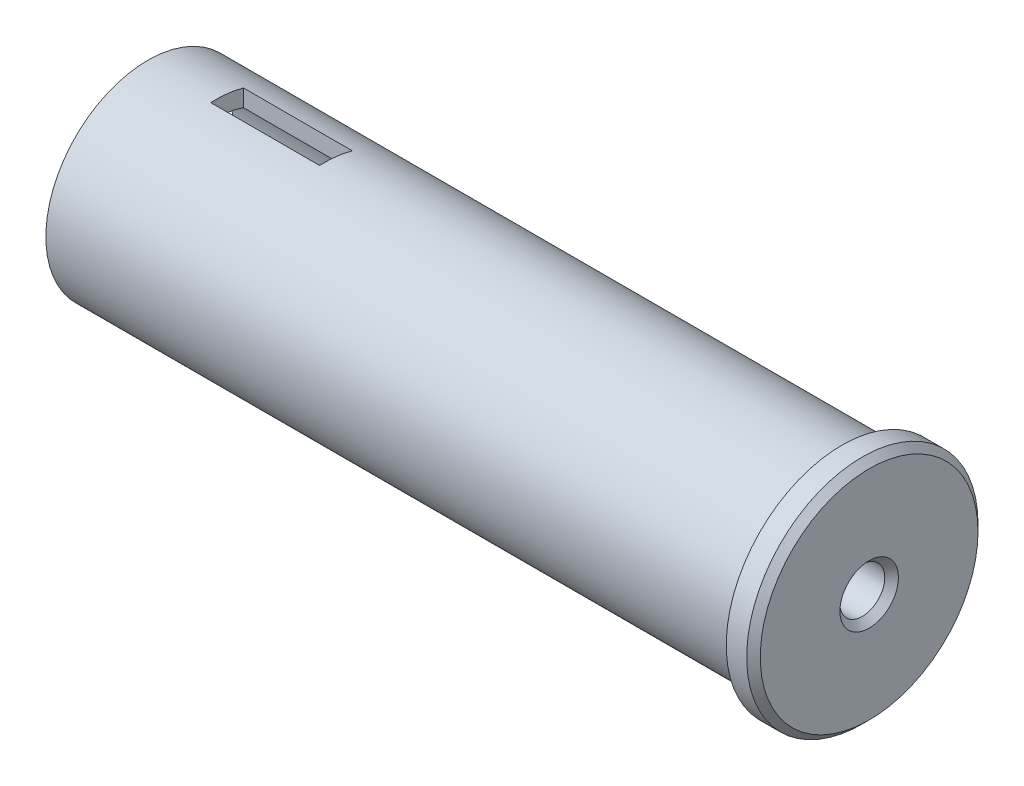
ISO-10303-21;
HEADER;
FILE_DESCRIPTION(('STEP AP214'),'2;1');
FILE_NAME('part.step','',(''),(''),'','','');
FILE_SCHEMA(('AUTOMOTIVE_DESIGN { 1 0 10303 214 1 1 1 1 }'));
ENDSEC;
DATA;
#1=APPLICATION_CONTEXT('core data for automotive mechanical design processes');
#2=APPLICATION_PROTOCOL_DEFINITION('international standard','automotive_design',2000,#1);
#3=PRODUCT_CONTEXT('',#1,'mechanical');
#4=PRODUCT('Part','Part','',(#3));
#5=PRODUCT_RELATED_PRODUCT_CATEGORY('part','',(#4));
#6=PRODUCT_DEFINITION_FORMATION('','',#4);
#7=PRODUCT_DEFINITION_CONTEXT('part definition',#1,'design');
#8=PRODUCT_DEFINITION('design','',#6,#7);
#9=PRODUCT_DEFINITION_SHAPE('','',#8);
#10=(LENGTH_UNIT() NAMED_UNIT(*) SI_UNIT(.MILLI.,.METRE.));
#11=(NAMED_UNIT(*) PLANE_ANGLE_UNIT() SI_UNIT($,.RADIAN.));
#12=(NAMED_UNIT(*) SI_UNIT($,.STERADIAN.) SOLID_ANGLE_UNIT());
#13=UNCERTAINTY_MEASURE_WITH_UNIT(LENGTH_MEASURE(1.E-05),#10,'distance_accuracy_value','');
#14=(GEOMETRIC_REPRESENTATION_CONTEXT(3) GLOBAL_UNCERTAINTY_ASSIGNED_CONTEXT((#13)) GLOBAL_UNIT_ASSIGNED_CONTEXT((#10,
#11,#12)) REPRESENTATION_CONTEXT('',''));
#15=CARTESIAN_POINT('',(0.,0.,0.));
#16=DIRECTION('',(0.,0.,1.));
#17=DIRECTION('',(1.,0.,0.));
#18=AXIS2_PLACEMENT_3D('',#15,#16,#17);
#19=CARTESIAN_POINT('',(0.,0.,-8.50000000000001));
#20=DIRECTION('',(1.,0.,0.));
#21=DIRECTION('',(0.,0.,-1.));
#22=AXIS2_PLACEMENT_3D('',#19,#20,#21);
#23=PLANE('',#22);
#24=CARTESIAN_POINT('',(0.,0.,0.));
#25=DIRECTION('',(1.,0.,0.));
#26=DIRECTION('',(0.,0.,-1.));
#27=AXIS2_PLACEMENT_3D('',#24,#25,#26);
#28=CIRCLE('',#27,2.15);
#29=CARTESIAN_POINT('',(0.,0.,-2.15));
#30=VERTEX_POINT('',#29);
#31=EDGE_CURVE('E155',#30,#30,#28,.F.);
#32=ORIENTED_EDGE('',*,*,#31,.T.);
#33=EDGE_LOOP('',(#32));
#34=FACE_BOUND('',#33,.T.);
#35=CARTESIAN_POINT('',(0.,0.,0.));
#36=DIRECTION('',(1.,0.,0.));
#37=DIRECTION('',(0.,0.,-1.));
#38=AXIS2_PLACEMENT_3D('',#35,#36,#37);
#39=CIRCLE('',#38,8.00000000000001);
#40=CARTESIAN_POINT('',(0.,0.,-8.00000000000001));
#41=VERTEX_POINT('',#40);
#42=EDGE_CURVE('E152',#41,#41,#39,.T.);
#43=ORIENTED_EDGE('',*,*,#42,.T.);
#44=EDGE_LOOP('',(#43));
#45=FACE_BOUND('',#44,.T.);
#46=ADVANCED_FACE('F33',(#34,#45),#23,.T.);
#47=CARTESIAN_POINT('',(0.,0.,0.));
#48=DIRECTION('',(1.,0.,0.));
#49=DIRECTION('',(0.,0.,-1.));
#50=AXIS2_PLACEMENT_3D('',#47,#48,#49);
#51=CYLINDRICAL_SURFACE('',#50,1.65);
#52=CARTESIAN_POINT('',(-0.500000000000004,0.,0.));
#53=DIRECTION('',(1.,0.,0.));
#54=DIRECTION('',(0.,0.,-1.));
#55=AXIS2_PLACEMENT_3D('',#52,#53,#54);
#56=CIRCLE('',#55,1.65);
#57=CARTESIAN_POINT('',(-0.500000000000004,0.,-1.65));
#58=VERTEX_POINT('',#57);
#59=EDGE_CURVE('E149',#58,#58,#56,.T.);
#60=ORIENTED_EDGE('',*,*,#59,.T.);
#61=EDGE_LOOP('',(#60));
#62=FACE_BOUND('',#61,.T.);
#63=CARTESIAN_POINT('',(-11.,0.,0.));
#64=DIRECTION('',(1.,0.,0.));
#65=DIRECTION('',(0.,0.,-1.));
#66=AXIS2_PLACEMENT_3D('',#63,#64,#65);
#67=CIRCLE('',#66,1.65);
#68=CARTESIAN_POINT('',(-11.,0.,-1.65));
#69=VERTEX_POINT('',#68);
#70=EDGE_CURVE('E146',#69,#69,#67,.T.);
#71=ORIENTED_EDGE('',*,*,#70,.F.);
#72=EDGE_LOOP('',(#71));
#73=FACE_BOUND('',#72,.T.);
#74=ADVANCED_FACE('F218',(#62,#73),#51,.F.);
#75=CARTESIAN_POINT('',(-11.,0.,-1.65));
#76=DIRECTION('',(-1.,0.,0.));
#77=DIRECTION('',(0.,0.,1.));
#78=AXIS2_PLACEMENT_3D('',#75,#76,#77);
#79=PLANE('',#78);
#80=ORIENTED_EDGE('',*,*,#70,.T.);
#81=EDGE_LOOP('',(#80));
#82=FACE_BOUND('',#81,.T.);
#83=CARTESIAN_POINT('',(-11.,0.,0.));
#84=DIRECTION('',(1.,0.,0.));
#85=DIRECTION('',(0.,0.,-1.));
#86=AXIS2_PLACEMENT_3D('',#83,#84,#85);
#87=CIRCLE('',#86,6.30000000000001);
#88=CARTESIAN_POINT('',(-11.,0.,-6.30000000000001));
#89=VERTEX_POINT('',#88);
#90=EDGE_CURVE('E143',#89,#89,#87,.T.);
#91=ORIENTED_EDGE('',*,*,#90,.F.);
#92=EDGE_LOOP('',(#91));
#93=FACE_BOUND('',#92,.T.);
#94=ADVANCED_FACE('F224',(#82,#93),#79,.T.);
#95=CARTESIAN_POINT('',(0.,0.,0.));
#96=DIRECTION('',(1.,0.,0.));
#97=DIRECTION('',(0.,0.,-1.));
#98=AXIS2_PLACEMENT_3D('',#95,#96,#97);
#99=CYLINDRICAL_SURFACE('',#98,6.30000000000001);
#100=CARTESIAN_POINT('',(-48.,0.,0.));
#101=DIRECTION('',(-1.,0.,0.));
#102=DIRECTION('',(0.,0.,1.));
#103=AXIS2_PLACEMENT_3D('',#100,#101,#102);
#104=CIRCLE('',#103,6.30000000000001);
#105=CARTESIAN_POINT('',(-48.,-5.96837058150195,-2.0170653439743));
#106=VERTEX_POINT('',#105);
#107=CARTESIAN_POINT('',(-48.,-6.28835121865935,0.382934656025704));
#108=VERTEX_POINT('',#107);
#109=EDGE_CURVE('E128',#106,#108,#104,.T.);
#110=ORIENTED_EDGE('',*,*,#109,.F.);
#111=DIRECTION('',(1.,0.,0.));
#112=VECTOR('',#111,1.);
#113=CARTESIAN_POINT('',(0.,-5.96837058150195,-2.0170653439743));
#114=LINE('',#113,#112);
#115=CARTESIAN_POINT('',(-40.,-5.96837058150195,-2.0170653439743));
#116=VERTEX_POINT('',#115);
#117=EDGE_CURVE('E120',#116,#106,#114,.F.);
#118=ORIENTED_EDGE('',*,*,#117,.F.);
#119=CARTESIAN_POINT('',(-40.,0.,0.));
#120=DIRECTION('',(1.,0.,0.));
#121=DIRECTION('',(0.,0.,-1.));
#122=AXIS2_PLACEMENT_3D('',#119,#120,#121);
#123=CIRCLE('',#122,6.30000000000001);
#124=CARTESIAN_POINT('',(-40.,-6.28835121865935,0.382934656025703));
#125=VERTEX_POINT('',#124);
#126=EDGE_CURVE('E105',#125,#116,#123,.T.);
#127=ORIENTED_EDGE('',*,*,#126,.F.);
#128=DIRECTION('',(1.,0.,0.));
#129=VECTOR('',#128,1.);
#130=CARTESIAN_POINT('',(0.,-6.28835121865935,0.382934656025698));
#131=LINE('',#130,#129);
#132=EDGE_CURVE('E97',#108,#125,#131,.T.);
#133=ORIENTED_EDGE('',*,*,#132,.F.);
#134=EDGE_LOOP('',(#110,#118,#127,#133));
#135=FACE_BOUND('',#134,.T.);
#136=CARTESIAN_POINT('',(-48.,6.28835121865935,0.382934656025704));
#137=VERTEX_POINT('',#136);
#138=CARTESIAN_POINT('',(-48.,5.96837058150195,-2.0170653439743));
#139=VERTEX_POINT('',#138);
#140=EDGE_CURVE('E130',#137,#139,#104,.T.);
#141=ORIENTED_EDGE('',*,*,#140,.F.);
#142=DIRECTION('',(1.,0.,0.));
#143=VECTOR('',#142,1.);
#144=CARTESIAN_POINT('',(0.,6.28835121865935,0.382934656025698));
#145=LINE('',#144,#143);
#146=CARTESIAN_POINT('',(-40.,6.28835121865935,0.382934656025703));
#147=VERTEX_POINT('',#146);
#148=EDGE_CURVE('E106',#147,#137,#145,.F.);
#149=ORIENTED_EDGE('',*,*,#148,.F.);
#150=CARTESIAN_POINT('',(-40.,5.96837058150195,-2.0170653439743));
#151=VERTEX_POINT('',#150);
#152=EDGE_CURVE('E121',#151,#147,#123,.T.);
#153=ORIENTED_EDGE('',*,*,#152,.F.);
#154=DIRECTION('',(1.,0.,0.));
#155=VECTOR('',#154,1.);
#156=CARTESIAN_POINT('',(0.,5.96837058150195,-2.0170653439743));
#157=LINE('',#156,#155);
#158=EDGE_CURVE('E126',#139,#151,#157,.T.);
#159=ORIENTED_EDGE('',*,*,#158,.F.);
#160=EDGE_LOOP('',(#141,#149,#153,#159));
#161=FACE_BOUND('',#160,.T.);
#162=ORIENTED_EDGE('',*,*,#90,.T.);
#163=EDGE_LOOP('',(#162));
#164=FACE_BOUND('',#163,.T.);
#165=CARTESIAN_POINT('',(-53.,0.,0.));
#166=DIRECTION('',(1.,0.,0.));
#167=DIRECTION('',(0.,0.,-1.));
#168=AXIS2_PLACEMENT_3D('',#165,#166,#167);
#169=CIRCLE('',#168,6.3);
#170=CARTESIAN_POINT('',(-53.,0.,-6.3));
#171=VERTEX_POINT('',#170);
#172=EDGE_CURVE('E140',#171,#171,#169,.T.);
#173=ORIENTED_EDGE('',*,*,#172,.F.);
#174=EDGE_LOOP('',(#173));
#175=FACE_BOUND('',#174,.T.);
#176=ADVANCED_FACE('F118',(#135,#161,#164,#175),#99,.F.);
#177=CARTESIAN_POINT('',(-53.,0.,-7.50000000000001));
#178=DIRECTION('',(-1.,0.,0.));
#179=DIRECTION('',(0.,0.,1.));
#180=AXIS2_PLACEMENT_3D('',#177,#178,#179);
#181=PLANE('',#180);
#182=ORIENTED_EDGE('',*,*,#172,.T.);
#183=EDGE_LOOP('',(#182));
#184=FACE_BOUND('',#183,.T.);
#185=CARTESIAN_POINT('',(-53.,0.,0.));
#186=DIRECTION('',(1.,0.,0.));
#187=DIRECTION('',(0.,0.,-1.));
#188=AXIS2_PLACEMENT_3D('',#185,#186,#187);
#189=CIRCLE('',#188,7.50000000000002);
#190=CARTESIAN_POINT('',(-53.,0.,-7.50000000000001));
#191=VERTEX_POINT('',#190);
#192=EDGE_CURVE('E137',#191,#191,#189,.T.);
#193=ORIENTED_EDGE('',*,*,#192,.F.);
#194=EDGE_LOOP('',(#193));
#195=FACE_BOUND('',#194,.T.);
#196=ADVANCED_FACE('F252',(#184,#195),#181,.T.);
#197=CARTESIAN_POINT('',(0.,0.,0.));
#198=DIRECTION('',(1.,0.,0.));
#199=DIRECTION('',(0.,0.,-1.));
#200=AXIS2_PLACEMENT_3D('',#197,#198,#199);
#201=CYLINDRICAL_SURFACE('',#200,7.50000000000001);
#202=CARTESIAN_POINT('',(-48.,0.,0.));
#203=DIRECTION('',(-1.,0.,0.));
#204=DIRECTION('',(0.,0.,1.));
#205=AXIS2_PLACEMENT_3D('',#202,#203,#204);
#206=CIRCLE('',#205,7.50000000000001);
#207=CARTESIAN_POINT('',(-48.,-7.49021769037553,0.382934656025704));
#208=VERTEX_POINT('',#207);
#209=CARTESIAN_POINT('',(-48.,-7.2236727084038,-2.0170653439743));
#210=VERTEX_POINT('',#209);
#211=EDGE_CURVE('E11',#208,#210,#206,.F.);
#212=ORIENTED_EDGE('',*,*,#211,.F.);
#213=DIRECTION('',(1.,0.,0.));
#214=VECTOR('',#213,1.);
#215=CARTESIAN_POINT('',(0.,-7.49021769037553,0.382934656025698));
#216=LINE('',#215,#214);
#217=CARTESIAN_POINT('',(-40.,-7.49021769037553,0.382934656025703));
#218=VERTEX_POINT('',#217);
#219=EDGE_CURVE('E167',#218,#208,#216,.F.);
#220=ORIENTED_EDGE('',*,*,#219,.F.);
#221=CARTESIAN_POINT('',(-40.,0.,0.));
#222=DIRECTION('',(1.,0.,0.));
#223=DIRECTION('',(0.,0.,-1.));
#224=AXIS2_PLACEMENT_3D('',#221,#222,#223);
#225=CIRCLE('',#224,7.50000000000001);
#226=CARTESIAN_POINT('',(-40.,-7.2236727084038,-2.0170653439743));
#227=VERTEX_POINT('',#226);
#228=EDGE_CURVE('E113',#227,#218,#225,.F.);
#229=ORIENTED_EDGE('',*,*,#228,.F.);
#230=DIRECTION('',(1.,0.,0.));
#231=VECTOR('',#230,1.);
#232=CARTESIAN_POINT('',(0.,-7.2236727084038,-2.0170653439743));
#233=LINE('',#232,#231);
#234=EDGE_CURVE('E37',#210,#227,#233,.T.);
#235=ORIENTED_EDGE('',*,*,#234,.F.);
#236=EDGE_LOOP('',(#212,#220,#229,#235));
#237=FACE_BOUND('',#236,.T.);
#238=CARTESIAN_POINT('',(-48.,7.2236727084038,-2.0170653439743));
#239=VERTEX_POINT('',#238);
#240=CARTESIAN_POINT('',(-48.,7.49021769037553,0.382934656025704));
#241=VERTEX_POINT('',#240);
#242=EDGE_CURVE('E43',#239,#241,#206,.F.);
#243=ORIENTED_EDGE('',*,*,#242,.F.);
#244=DIRECTION('',(1.,0.,0.));
#245=VECTOR('',#244,1.);
#246=CARTESIAN_POINT('',(0.,7.2236727084038,-2.0170653439743));
#247=LINE('',#246,#245);
#248=CARTESIAN_POINT('',(-40.,7.2236727084038,-2.0170653439743));
#249=VERTEX_POINT('',#248);
#250=EDGE_CURVE('E165',#249,#239,#247,.F.);
#251=ORIENTED_EDGE('',*,*,#250,.F.);
#252=CARTESIAN_POINT('',(-40.,7.49021769037553,0.382934656025703));
#253=VERTEX_POINT('',#252);
#254=EDGE_CURVE('E163',#253,#249,#225,.F.);
#255=ORIENTED_EDGE('',*,*,#254,.F.);
#256=DIRECTION('',(1.,0.,0.));
#257=VECTOR('',#256,1.);
#258=CARTESIAN_POINT('',(0.,7.49021769037553,0.382934656025698));
#259=LINE('',#258,#257);
#260=EDGE_CURVE('E161',#241,#253,#259,.T.);
#261=ORIENTED_EDGE('',*,*,#260,.F.);
#262=EDGE_LOOP('',(#243,#251,#255,#261));
#263=FACE_BOUND('',#262,.T.);
#264=ORIENTED_EDGE('',*,*,#192,.T.);
#265=EDGE_LOOP('',(#264));
#266=FACE_BOUND('',#265,.T.);
#267=CARTESIAN_POINT('',(-2.,0.,0.));
#268=DIRECTION('',(1.,0.,0.));
#269=DIRECTION('',(0.,0.,-1.));
#270=AXIS2_PLACEMENT_3D('',#267,#268,#269);
#271=CIRCLE('',#270,7.5);
#272=CARTESIAN_POINT('',(-2.,0.,-7.5));
#273=VERTEX_POINT('',#272);
#274=EDGE_CURVE('E134',#273,#273,#271,.T.);
#275=ORIENTED_EDGE('',*,*,#274,.F.);
#276=EDGE_LOOP('',(#275));
#277=FACE_BOUND('',#276,.T.);
#278=ADVANCED_FACE('F179',(#237,#263,#266,#277),#201,.T.);
#279=CARTESIAN_POINT('',(-2.,0.,-7.5));
#280=DIRECTION('',(-1.,0.,0.));
#281=DIRECTION('',(0.,0.,1.));
#282=AXIS2_PLACEMENT_3D('',#279,#280,#281);
#283=PLANE('',#282);
#284=ORIENTED_EDGE('',*,*,#274,.T.);
#285=EDGE_LOOP('',(#284));
#286=FACE_BOUND('',#285,.T.);
#287=CARTESIAN_POINT('',(-2.,0.,0.));
#288=DIRECTION('',(1.,0.,0.));
#289=DIRECTION('',(0.,0.,-1.));
#290=AXIS2_PLACEMENT_3D('',#287,#288,#289);
#291=CIRCLE('',#290,8.5);
#292=CARTESIAN_POINT('',(-2.,0.,-8.5));
#293=VERTEX_POINT('',#292);
#294=EDGE_CURVE('E131',#293,#293,#291,.T.);
#295=ORIENTED_EDGE('',*,*,#294,.F.);
#296=EDGE_LOOP('',(#295));
#297=FACE_BOUND('',#296,.T.);
#298=ADVANCED_FACE('F238',(#286,#297),#283,.T.);
#299=CARTESIAN_POINT('',(0.,0.,0.));
#300=DIRECTION('',(1.,0.,0.));
#301=DIRECTION('',(0.,0.,-1.));
#302=AXIS2_PLACEMENT_3D('',#299,#300,#301);
#303=CYLINDRICAL_SURFACE('',#302,8.5);
#304=CARTESIAN_POINT('',(-0.499999999999991,0.,0.));
#305=DIRECTION('',(1.,0.,0.));
#306=DIRECTION('',(0.,0.,-1.));
#307=AXIS2_PLACEMENT_3D('',#304,#305,#306);
#308=CIRCLE('',#307,8.5);
#309=CARTESIAN_POINT('',(-0.499999999999992,0.,-8.5));
#310=VERTEX_POINT('',#309);
#311=EDGE_CURVE('E158',#310,#310,#308,.F.);
#312=ORIENTED_EDGE('',*,*,#311,.T.);
#313=EDGE_LOOP('',(#312));
#314=FACE_BOUND('',#313,.T.);
#315=ORIENTED_EDGE('',*,*,#294,.T.);
#316=EDGE_LOOP('',(#315));
#317=FACE_BOUND('',#316,.T.);
#318=ADVANCED_FACE('F231',(#314,#317),#303,.T.);
#319=CARTESIAN_POINT('',(-0.500000000000004,0.,0.));
#320=DIRECTION('',(1.,0.,0.));
#321=DIRECTION('',(0.,0.,-1.));
#322=AXIS2_PLACEMENT_3D('',#319,#320,#321);
#323=CONICAL_SURFACE('',#322,1.65,0.785398163397443);
#324=ORIENTED_EDGE('',*,*,#31,.F.);
#325=EDGE_LOOP('',(#324));
#326=FACE_BOUND('',#325,.T.);
#327=ORIENTED_EDGE('',*,*,#59,.F.);
#328=EDGE_LOOP('',(#327));
#329=FACE_BOUND('',#328,.T.);
#330=ADVANCED_FACE('F229',(#326,#329),#323,.F.);
#331=CARTESIAN_POINT('',(0.,0.,0.));
#332=DIRECTION('',(-1.,0.,0.));
#333=DIRECTION('',(0.,0.,1.));
#334=AXIS2_PLACEMENT_3D('',#331,#332,#333);
#335=CONICAL_SURFACE('',#334,8.00000000000001,0.785398163397454);
#336=ORIENTED_EDGE('',*,*,#311,.F.);
#337=EDGE_LOOP('',(#336));
#338=FACE_BOUND('',#337,.T.);
#339=ORIENTED_EDGE('',*,*,#42,.F.);
#340=EDGE_LOOP('',(#339));
#341=FACE_BOUND('',#340,.T.);
#342=ADVANCED_FACE('F35',(#338,#341),#335,.T.);
#343=CARTESIAN_POINT('',(-40.,-8.5,0.382934656025703));
#344=DIRECTION('',(0.,0.,1.));
#345=DIRECTION('',(1.,0.,0.));
#346=AXIS2_PLACEMENT_3D('',#343,#344,#345);
#347=PLANE('',#346);
#348=ORIENTED_EDGE('',*,*,#148,.T.);
#349=DIRECTION('',(0.,1.,0.));
#350=VECTOR('',#349,1.);
#351=CARTESIAN_POINT('',(-48.,-8.5,0.382934656025704));
#352=LINE('',#351,#350);
#353=EDGE_CURVE('E183',#137,#241,#352,.T.);
#354=ORIENTED_EDGE('',*,*,#353,.T.);
#355=ORIENTED_EDGE('',*,*,#260,.T.);
#356=DIRECTION('',(0.,1.,0.));
#357=VECTOR('',#356,1.);
#358=CARTESIAN_POINT('',(-40.,-8.5,0.382934656025703));
#359=LINE('',#358,#357);
#360=EDGE_CURVE('E58',#147,#253,#359,.T.);
#361=ORIENTED_EDGE('',*,*,#360,.F.);
#362=EDGE_LOOP('',(#348,#354,#355,#361));
#363=FACE_BOUND('',#362,.T.);
#364=ADVANCED_FACE('F208',(#363),#347,.F.);
#365=CARTESIAN_POINT('',(-40.,-8.5,-2.0170653439743));
#366=DIRECTION('',(1.,0.,0.));
#367=DIRECTION('',(0.,0.,-1.));
#368=AXIS2_PLACEMENT_3D('',#365,#366,#367);
#369=PLANE('',#368);
#370=ORIENTED_EDGE('',*,*,#152,.T.);
#371=ORIENTED_EDGE('',*,*,#360,.T.);
#372=ORIENTED_EDGE('',*,*,#254,.T.);
#373=DIRECTION('',(0.,1.,0.));
#374=VECTOR('',#373,1.);
#375=CARTESIAN_POINT('',(-40.,-8.5,-2.0170653439743));
#376=LINE('',#375,#374);
#377=EDGE_CURVE('E115',#151,#249,#376,.T.);
#378=ORIENTED_EDGE('',*,*,#377,.F.);
#379=EDGE_LOOP('',(#370,#371,#372,#378));
#380=FACE_BOUND('',#379,.T.);
#381=ADVANCED_FACE('F206',(#380),#369,.F.);
#382=CARTESIAN_POINT('',(-40.,-8.5,-2.0170653439743));
#383=DIRECTION('',(0.,0.,-1.));
#384=DIRECTION('',(-1.,0.,0.));
#385=AXIS2_PLACEMENT_3D('',#382,#383,#384);
#386=PLANE('',#385);
#387=ORIENTED_EDGE('',*,*,#158,.T.);
#388=ORIENTED_EDGE('',*,*,#377,.T.);
#389=ORIENTED_EDGE('',*,*,#250,.T.);
#390=DIRECTION('',(0.,1.,0.));
#391=VECTOR('',#390,1.);
#392=CARTESIAN_POINT('',(-48.,-8.5,-2.0170653439743));
#393=LINE('',#392,#391);
#394=EDGE_CURVE('E177',#139,#239,#393,.T.);
#395=ORIENTED_EDGE('',*,*,#394,.F.);
#396=EDGE_LOOP('',(#387,#388,#389,#395));
#397=FACE_BOUND('',#396,.T.);
#398=ADVANCED_FACE('F193',(#397),#386,.F.);
#399=CARTESIAN_POINT('',(-48.,-8.5,-2.0170653439743));
#400=DIRECTION('',(-1.,0.,0.));
#401=DIRECTION('',(0.,0.,1.));
#402=AXIS2_PLACEMENT_3D('',#399,#400,#401);
#403=PLANE('',#402);
#404=ORIENTED_EDGE('',*,*,#140,.T.);
#405=ORIENTED_EDGE('',*,*,#394,.T.);
#406=ORIENTED_EDGE('',*,*,#242,.T.);
#407=ORIENTED_EDGE('',*,*,#353,.F.);
#408=EDGE_LOOP('',(#404,#405,#406,#407));
#409=FACE_BOUND('',#408,.T.);
#410=ADVANCED_FACE('F203',(#409),#403,.F.);
#411=ORIENTED_EDGE('',*,*,#132,.T.);
#412=EDGE_CURVE('E100',#218,#125,#359,.T.);
#413=ORIENTED_EDGE('',*,*,#412,.F.);
#414=ORIENTED_EDGE('',*,*,#219,.T.);
#415=EDGE_CURVE('E50',#208,#108,#352,.T.);
#416=ORIENTED_EDGE('',*,*,#415,.T.);
#417=EDGE_LOOP('',(#411,#413,#414,#416));
#418=FACE_BOUND('',#417,.T.);
#419=ADVANCED_FACE('F99',(#418),#347,.F.);
#420=ORIENTED_EDGE('',*,*,#109,.T.);
#421=ORIENTED_EDGE('',*,*,#415,.F.);
#422=ORIENTED_EDGE('',*,*,#211,.T.);
#423=EDGE_CURVE('E174',#210,#106,#393,.T.);
#424=ORIENTED_EDGE('',*,*,#423,.T.);
#425=EDGE_LOOP('',(#420,#421,#422,#424));
#426=FACE_BOUND('',#425,.T.);
#427=ADVANCED_FACE('F182',(#426),#403,.F.);
#428=ORIENTED_EDGE('',*,*,#117,.T.);
#429=ORIENTED_EDGE('',*,*,#423,.F.);
#430=ORIENTED_EDGE('',*,*,#234,.T.);
#431=EDGE_CURVE('E172',#227,#116,#376,.T.);
#432=ORIENTED_EDGE('',*,*,#431,.T.);
#433=EDGE_LOOP('',(#428,#429,#430,#432));
#434=FACE_BOUND('',#433,.T.);
#435=ADVANCED_FACE('F171',(#434),#386,.F.);
#436=ORIENTED_EDGE('',*,*,#126,.T.);
#437=ORIENTED_EDGE('',*,*,#431,.F.);
#438=ORIENTED_EDGE('',*,*,#228,.T.);
#439=ORIENTED_EDGE('',*,*,#412,.T.);
#440=EDGE_LOOP('',(#436,#437,#438,#439));
#441=FACE_BOUND('',#440,.T.);
#442=ADVANCED_FACE('F109',(#441),#369,.F.);
#443=CLOSED_SHELL('',(#46,#74,#94,#176,#196,#278,#298,#318,#330,#342,#364,#381,#398,#410,#419,
#427,#435,#442));
#444=MANIFOLD_SOLID_BREP('B2',#443);
#445=ADVANCED_BREP_SHAPE_REPRESENTATION('',(#18,#444),#14);
#446=SHAPE_DEFINITION_REPRESENTATION(#9,#445);
ENDSEC;
END-ISO-10303-21;
